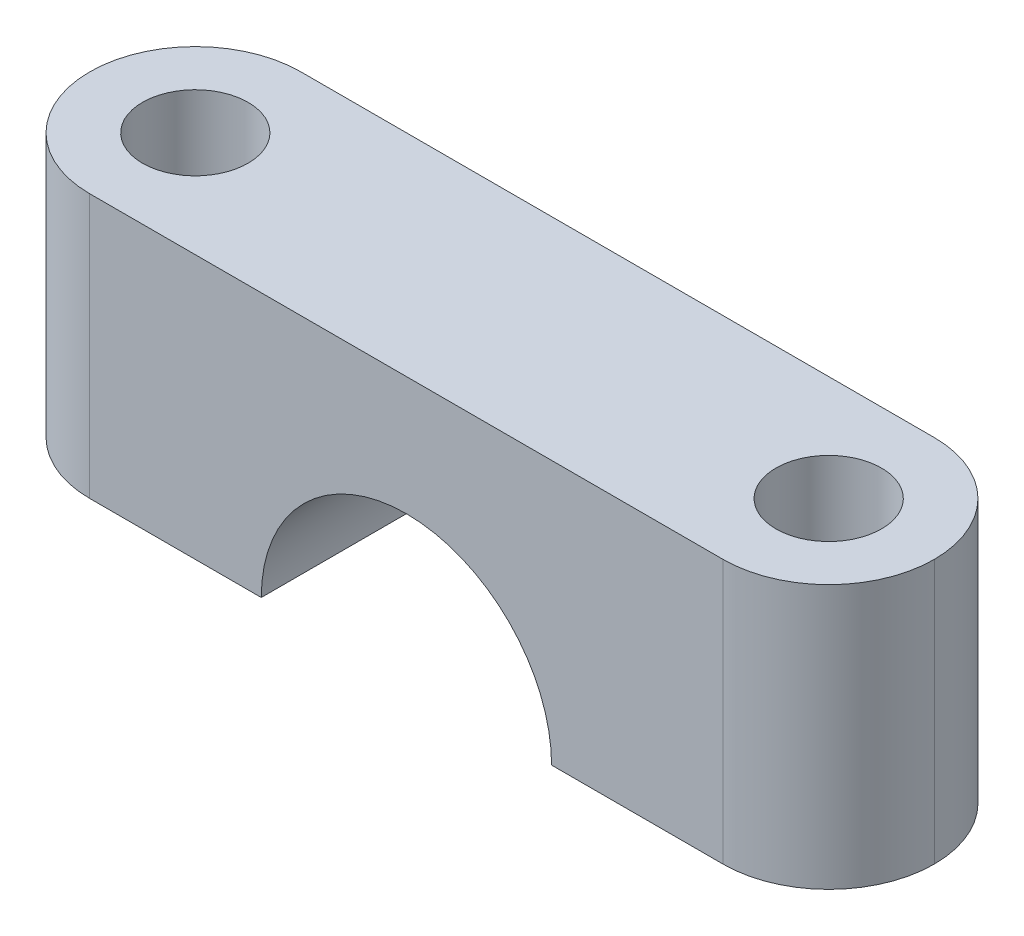
ISO-10303-21;
HEADER;
FILE_DESCRIPTION(('STEP AP214'),'2;1');
FILE_NAME('part.step','',(''),(''),'','','');
FILE_SCHEMA(('AUTOMOTIVE_DESIGN { 1 0 10303 214 1 1 1 1 }'));
ENDSEC;
DATA;
#1=APPLICATION_CONTEXT('core data for automotive mechanical design processes');
#2=APPLICATION_PROTOCOL_DEFINITION('international standard','automotive_design',2000,#1);
#3=PRODUCT_CONTEXT('',#1,'mechanical');
#4=PRODUCT('Part','Part','',(#3));
#5=PRODUCT_RELATED_PRODUCT_CATEGORY('part','',(#4));
#6=PRODUCT_DEFINITION_FORMATION('','',#4);
#7=PRODUCT_DEFINITION_CONTEXT('part definition',#1,'design');
#8=PRODUCT_DEFINITION('design','',#6,#7);
#9=PRODUCT_DEFINITION_SHAPE('','',#8);
#10=(LENGTH_UNIT() NAMED_UNIT(*) SI_UNIT(.MILLI.,.METRE.));
#11=(NAMED_UNIT(*) PLANE_ANGLE_UNIT() SI_UNIT($,.RADIAN.));
#12=(NAMED_UNIT(*) SI_UNIT($,.STERADIAN.) SOLID_ANGLE_UNIT());
#13=UNCERTAINTY_MEASURE_WITH_UNIT(LENGTH_MEASURE(1.E-05),#10,'distance_accuracy_value','');
#14=(GEOMETRIC_REPRESENTATION_CONTEXT(3) GLOBAL_UNCERTAINTY_ASSIGNED_CONTEXT((#13)) GLOBAL_UNIT_ASSIGNED_CONTEXT((#10,
#11,#12)) REPRESENTATION_CONTEXT('',''));
#15=CARTESIAN_POINT('',(0.,0.,0.));
#16=DIRECTION('',(0.,0.,1.));
#17=DIRECTION('',(1.,0.,0.));
#18=AXIS2_PLACEMENT_3D('',#15,#16,#17);
#19=CARTESIAN_POINT('',(0.,0.,6.35));
#20=DIRECTION('',(0.,0.,-1.));
#21=DIRECTION('',(-1.,0.,0.));
#22=AXIS2_PLACEMENT_3D('',#19,#20,#21);
#23=CYLINDRICAL_SURFACE('',#22,8.73125);
#24=CARTESIAN_POINT('',(0.,0.,-6.35));
#25=DIRECTION('',(0.,0.,-1.));
#26=DIRECTION('',(1.,0.,0.));
#27=AXIS2_PLACEMENT_3D('',#24,#25,#26);
#28=CIRCLE('',#27,8.73125);
#29=CARTESIAN_POINT('',(-8.73125,0.,-6.35));
#30=VERTEX_POINT('',#29);
#31=CARTESIAN_POINT('',(8.73125,0.,-6.35));
#32=VERTEX_POINT('',#31);
#33=EDGE_CURVE('E136',#30,#32,#28,.T.);
#34=ORIENTED_EDGE('',*,*,#33,.T.);
#35=DIRECTION('',(0.,0.,-1.));
#36=VECTOR('',#35,1.);
#37=CARTESIAN_POINT('',(8.73125,0.,6.35));
#38=LINE('',#37,#36);
#39=CARTESIAN_POINT('',(8.73125,0.,6.35));
#40=VERTEX_POINT('',#39);
#41=EDGE_CURVE('E119',#40,#32,#38,.T.);
#42=ORIENTED_EDGE('',*,*,#41,.F.);
#43=CARTESIAN_POINT('',(0.,0.,6.35));
#44=DIRECTION('',(0.,0.,-1.));
#45=DIRECTION('',(1.,0.,0.));
#46=AXIS2_PLACEMENT_3D('',#43,#44,#45);
#47=CIRCLE('',#46,8.73125);
#48=CARTESIAN_POINT('',(-8.73125,0.,6.35));
#49=VERTEX_POINT('',#48);
#50=EDGE_CURVE('E125',#49,#40,#47,.T.);
#51=ORIENTED_EDGE('',*,*,#50,.F.);
#52=DIRECTION('',(0.,0.,-1.));
#53=VECTOR('',#52,1.);
#54=CARTESIAN_POINT('',(-8.73125,0.,6.35));
#55=LINE('',#54,#53);
#56=EDGE_CURVE('E138',#49,#30,#55,.T.);
#57=ORIENTED_EDGE('',*,*,#56,.T.);
#58=EDGE_LOOP('',(#34,#42,#51,#57));
#59=FACE_BOUND('',#58,.T.);
#60=ADVANCED_FACE('F48',(#59),#23,.F.);
#61=CARTESIAN_POINT('',(25.4,0.,6.35));
#62=DIRECTION('',(0.,1.,0.));
#63=DIRECTION('',(-1.,0.,0.));
#64=AXIS2_PLACEMENT_3D('',#61,#62,#63);
#65=PLANE('',#64);
#66=CARTESIAN_POINT('',(19.05,0.,0.));
#67=DIRECTION('',(0.,1.,0.));
#68=DIRECTION('',(0.,0.,1.));
#69=AXIS2_PLACEMENT_3D('',#66,#67,#68);
#70=CIRCLE('',#69,3.175);
#71=CARTESIAN_POINT('',(19.05,0.,3.17499999999999));
#72=VERTEX_POINT('',#71);
#73=EDGE_CURVE('E164',#72,#72,#70,.T.);
#74=ORIENTED_EDGE('',*,*,#73,.T.);
#75=EDGE_LOOP('',(#74));
#76=FACE_BOUND('',#75,.T.);
#77=DIRECTION('',(1.,0.,0.));
#78=VECTOR('',#77,1.);
#79=CARTESIAN_POINT('',(25.4,0.,-6.35));
#80=LINE('',#79,#78);
#81=CARTESIAN_POINT('',(19.05,0.,-6.35));
#82=VERTEX_POINT('',#81);
#83=EDGE_CURVE('E187',#32,#82,#80,.T.);
#84=ORIENTED_EDGE('',*,*,#83,.T.);
#85=CARTESIAN_POINT('',(19.05,0.,0.));
#86=DIRECTION('',(0.,1.,0.));
#87=DIRECTION('',(-1.,0.,0.));
#88=AXIS2_PLACEMENT_3D('',#85,#86,#87);
#89=CIRCLE('',#88,6.35);
#90=CARTESIAN_POINT('',(25.4,0.,0.));
#91=VERTEX_POINT('',#90);
#92=EDGE_CURVE('E157',#82,#91,#89,.F.);
#93=ORIENTED_EDGE('',*,*,#92,.T.);
#94=CARTESIAN_POINT('',(19.05,0.,0.));
#95=DIRECTION('',(0.,1.,0.));
#96=DIRECTION('',(-1.,0.,0.));
#97=AXIS2_PLACEMENT_3D('',#94,#95,#96);
#98=CIRCLE('',#97,6.35);
#99=CARTESIAN_POINT('',(19.05,0.,6.35));
#100=VERTEX_POINT('',#99);
#101=EDGE_CURVE('E122',#91,#100,#98,.F.);
#102=ORIENTED_EDGE('',*,*,#101,.T.);
#103=DIRECTION('',(1.,0.,0.));
#104=VECTOR('',#103,1.);
#105=CARTESIAN_POINT('',(25.4,0.,6.35));
#106=LINE('',#105,#104);
#107=EDGE_CURVE('E114',#40,#100,#106,.T.);
#108=ORIENTED_EDGE('',*,*,#107,.F.);
#109=ORIENTED_EDGE('',*,*,#41,.T.);
#110=EDGE_LOOP('',(#84,#93,#102,#108,#109));
#111=FACE_BOUND('',#110,.T.);
#112=ADVANCED_FACE('F117',(#76,#111),#65,.F.);
#113=CARTESIAN_POINT('',(-25.4,15.875,6.35));
#114=DIRECTION('',(0.,-1.,0.));
#115=DIRECTION('',(0.,0.,-1.));
#116=AXIS2_PLACEMENT_3D('',#113,#114,#115);
#117=PLANE('',#116);
#118=CARTESIAN_POINT('',(-19.05,15.875,0.));
#119=DIRECTION('',(0.,1.,0.));
#120=DIRECTION('',(0.,0.,1.));
#121=AXIS2_PLACEMENT_3D('',#118,#119,#120);
#122=CIRCLE('',#121,3.175);
#123=CARTESIAN_POINT('',(-19.05,15.875,3.17500000000001));
#124=VERTEX_POINT('',#123);
#125=EDGE_CURVE('E188',#124,#124,#122,.T.);
#126=ORIENTED_EDGE('',*,*,#125,.F.);
#127=EDGE_LOOP('',(#126));
#128=FACE_BOUND('',#127,.T.);
#129=CARTESIAN_POINT('',(19.05,15.875,0.));
#130=DIRECTION('',(0.,1.,0.));
#131=DIRECTION('',(0.,0.,1.));
#132=AXIS2_PLACEMENT_3D('',#129,#130,#131);
#133=CIRCLE('',#132,3.175);
#134=CARTESIAN_POINT('',(19.05,15.875,3.17499999999999));
#135=VERTEX_POINT('',#134);
#136=EDGE_CURVE('E169',#135,#135,#133,.T.);
#137=ORIENTED_EDGE('',*,*,#136,.F.);
#138=EDGE_LOOP('',(#137));
#139=FACE_BOUND('',#138,.T.);
#140=CARTESIAN_POINT('',(19.05,15.875,0.));
#141=DIRECTION('',(0.,-1.,0.));
#142=DIRECTION('',(0.,0.,-1.));
#143=AXIS2_PLACEMENT_3D('',#140,#141,#142);
#144=CIRCLE('',#143,6.35);
#145=CARTESIAN_POINT('',(19.05,15.875,6.35));
#146=VERTEX_POINT('',#145);
#147=CARTESIAN_POINT('',(25.4,15.875,0.));
#148=VERTEX_POINT('',#147);
#149=EDGE_CURVE('E146',#146,#148,#144,.F.);
#150=ORIENTED_EDGE('',*,*,#149,.T.);
#151=CARTESIAN_POINT('',(19.05,15.875,0.));
#152=DIRECTION('',(0.,-1.,0.));
#153=DIRECTION('',(0.,0.,-1.));
#154=AXIS2_PLACEMENT_3D('',#151,#152,#153);
#155=CIRCLE('',#154,6.35);
#156=CARTESIAN_POINT('',(19.05,15.875,-6.35));
#157=VERTEX_POINT('',#156);
#158=EDGE_CURVE('E148',#148,#157,#155,.F.);
#159=ORIENTED_EDGE('',*,*,#158,.T.);
#160=DIRECTION('',(-1.,0.,0.));
#161=VECTOR('',#160,1.);
#162=CARTESIAN_POINT('',(-25.4,15.875,-6.35));
#163=LINE('',#162,#161);
#164=CARTESIAN_POINT('',(-19.05,15.875,-6.35));
#165=VERTEX_POINT('',#164);
#166=EDGE_CURVE('E190',#157,#165,#163,.T.);
#167=ORIENTED_EDGE('',*,*,#166,.T.);
#168=CARTESIAN_POINT('',(-19.05,15.875,0.));
#169=DIRECTION('',(0.,-1.,0.));
#170=DIRECTION('',(0.,0.,-1.));
#171=AXIS2_PLACEMENT_3D('',#168,#169,#170);
#172=CIRCLE('',#171,6.35);
#173=CARTESIAN_POINT('',(-25.4,15.875,0.));
#174=VERTEX_POINT('',#173);
#175=EDGE_CURVE('E140',#165,#174,#172,.F.);
#176=ORIENTED_EDGE('',*,*,#175,.T.);
#177=CARTESIAN_POINT('',(-19.05,15.875,0.));
#178=DIRECTION('',(0.,-1.,0.));
#179=DIRECTION('',(0.,0.,-1.));
#180=AXIS2_PLACEMENT_3D('',#177,#178,#179);
#181=CIRCLE('',#180,6.35);
#182=CARTESIAN_POINT('',(-19.05,15.875,6.35));
#183=VERTEX_POINT('',#182);
#184=EDGE_CURVE('E137',#174,#183,#181,.F.);
#185=ORIENTED_EDGE('',*,*,#184,.T.);
#186=DIRECTION('',(-1.,0.,0.));
#187=VECTOR('',#186,1.);
#188=CARTESIAN_POINT('',(-25.4,15.875,6.35));
#189=LINE('',#188,#187);
#190=EDGE_CURVE('E124',#146,#183,#189,.T.);
#191=ORIENTED_EDGE('',*,*,#190,.F.);
#192=EDGE_LOOP('',(#150,#159,#167,#176,#185,#191));
#193=FACE_BOUND('',#192,.T.);
#194=ADVANCED_FACE('F180',(#128,#139,#193),#117,.F.);
#195=CARTESIAN_POINT('',(-8.73125,0.,6.35));
#196=DIRECTION('',(0.,1.,0.));
#197=DIRECTION('',(-1.,0.,0.));
#198=AXIS2_PLACEMENT_3D('',#195,#196,#197);
#199=PLANE('',#198);
#200=CARTESIAN_POINT('',(-19.05,0.,0.));
#201=DIRECTION('',(0.,1.,0.));
#202=DIRECTION('',(0.,0.,1.));
#203=AXIS2_PLACEMENT_3D('',#200,#201,#202);
#204=CIRCLE('',#203,3.175);
#205=CARTESIAN_POINT('',(-19.05,0.,3.17500000000001));
#206=VERTEX_POINT('',#205);
#207=EDGE_CURVE('E239',#206,#206,#204,.T.);
#208=ORIENTED_EDGE('',*,*,#207,.T.);
#209=EDGE_LOOP('',(#208));
#210=FACE_BOUND('',#209,.T.);
#211=CARTESIAN_POINT('',(-19.05,0.,0.));
#212=DIRECTION('',(0.,1.,0.));
#213=DIRECTION('',(-1.,0.,0.));
#214=AXIS2_PLACEMENT_3D('',#211,#212,#213);
#215=CIRCLE('',#214,6.35);
#216=CARTESIAN_POINT('',(-19.05,0.,6.35));
#217=VERTEX_POINT('',#216);
#218=CARTESIAN_POINT('',(-25.4,0.,0.));
#219=VERTEX_POINT('',#218);
#220=EDGE_CURVE('E57',#217,#219,#215,.F.);
#221=ORIENTED_EDGE('',*,*,#220,.T.);
#222=CARTESIAN_POINT('',(-19.05,0.,0.));
#223=DIRECTION('',(0.,1.,0.));
#224=DIRECTION('',(-1.,0.,0.));
#225=AXIS2_PLACEMENT_3D('',#222,#223,#224);
#226=CIRCLE('',#225,6.35);
#227=CARTESIAN_POINT('',(-19.05,0.,-6.35));
#228=VERTEX_POINT('',#227);
#229=EDGE_CURVE('E13',#219,#228,#226,.F.);
#230=ORIENTED_EDGE('',*,*,#229,.T.);
#231=DIRECTION('',(1.,0.,0.));
#232=VECTOR('',#231,1.);
#233=CARTESIAN_POINT('',(-8.73125,0.,-6.35));
#234=LINE('',#233,#232);
#235=EDGE_CURVE('E133',#228,#30,#234,.T.);
#236=ORIENTED_EDGE('',*,*,#235,.T.);
#237=ORIENTED_EDGE('',*,*,#56,.F.);
#238=DIRECTION('',(1.,0.,0.));
#239=VECTOR('',#238,1.);
#240=CARTESIAN_POINT('',(-8.73125,0.,6.35));
#241=LINE('',#240,#239);
#242=EDGE_CURVE('E129',#217,#49,#241,.T.);
#243=ORIENTED_EDGE('',*,*,#242,.F.);
#244=EDGE_LOOP('',(#221,#230,#236,#237,#243));
#245=FACE_BOUND('',#244,.T.);
#246=ADVANCED_FACE('F192',(#210,#245),#199,.F.);
#247=CARTESIAN_POINT('',(0.,0.,6.35));
#248=DIRECTION('',(0.,0.,1.));
#249=DIRECTION('',(1.,0.,0.));
#250=AXIS2_PLACEMENT_3D('',#247,#248,#249);
#251=PLANE('',#250);
#252=ORIENTED_EDGE('',*,*,#107,.T.);
#253=DIRECTION('',(0.,1.,0.));
#254=VECTOR('',#253,1.);
#255=CARTESIAN_POINT('',(19.05,15.875,6.35));
#256=LINE('',#255,#254);
#257=EDGE_CURVE('E160',#100,#146,#256,.T.);
#258=ORIENTED_EDGE('',*,*,#257,.T.);
#259=ORIENTED_EDGE('',*,*,#190,.T.);
#260=DIRECTION('',(0.,-1.,0.));
#261=VECTOR('',#260,1.);
#262=CARTESIAN_POINT('',(-19.05,0.,6.35));
#263=LINE('',#262,#261);
#264=EDGE_CURVE('E71',#183,#217,#263,.T.);
#265=ORIENTED_EDGE('',*,*,#264,.T.);
#266=ORIENTED_EDGE('',*,*,#242,.T.);
#267=ORIENTED_EDGE('',*,*,#50,.T.);
#268=EDGE_LOOP('',(#252,#258,#259,#265,#266,#267));
#269=FACE_BOUND('',#268,.T.);
#270=ADVANCED_FACE('F128',(#269),#251,.T.);
#271=CARTESIAN_POINT('',(0.,0.,-6.35));
#272=DIRECTION('',(0.,0.,1.));
#273=DIRECTION('',(1.,0.,0.));
#274=AXIS2_PLACEMENT_3D('',#271,#272,#273);
#275=PLANE('',#274);
#276=ORIENTED_EDGE('',*,*,#166,.F.);
#277=DIRECTION('',(0.,1.,0.));
#278=VECTOR('',#277,1.);
#279=CARTESIAN_POINT('',(19.05,0.,-6.35));
#280=LINE('',#279,#278);
#281=EDGE_CURVE('E153',#157,#82,#280,.F.);
#282=ORIENTED_EDGE('',*,*,#281,.T.);
#283=ORIENTED_EDGE('',*,*,#83,.F.);
#284=ORIENTED_EDGE('',*,*,#33,.F.);
#285=ORIENTED_EDGE('',*,*,#235,.F.);
#286=DIRECTION('',(0.,-1.,0.));
#287=VECTOR('',#286,1.);
#288=CARTESIAN_POINT('',(-19.05,0.,-6.35));
#289=LINE('',#288,#287);
#290=EDGE_CURVE('E150',#228,#165,#289,.F.);
#291=ORIENTED_EDGE('',*,*,#290,.T.);
#292=EDGE_LOOP('',(#276,#282,#283,#284,#285,#291));
#293=FACE_BOUND('',#292,.T.);
#294=ADVANCED_FACE('F195',(#293),#275,.F.);
#295=CARTESIAN_POINT('',(-19.05,15.875,0.));
#296=DIRECTION('',(0.,-1.,0.));
#297=DIRECTION('',(0.,0.,-1.));
#298=AXIS2_PLACEMENT_3D('',#295,#296,#297);
#299=CYLINDRICAL_SURFACE('',#298,3.175);
#300=ORIENTED_EDGE('',*,*,#125,.T.);
#301=EDGE_LOOP('',(#300));
#302=FACE_BOUND('',#301,.T.);
#303=ORIENTED_EDGE('',*,*,#207,.F.);
#304=EDGE_LOOP('',(#303));
#305=FACE_BOUND('',#304,.T.);
#306=ADVANCED_FACE('F224',(#302,#305),#299,.F.);
#307=CARTESIAN_POINT('',(19.05,15.875,0.));
#308=DIRECTION('',(0.,-1.,0.));
#309=DIRECTION('',(0.,0.,-1.));
#310=AXIS2_PLACEMENT_3D('',#307,#308,#309);
#311=CYLINDRICAL_SURFACE('',#310,3.175);
#312=ORIENTED_EDGE('',*,*,#136,.T.);
#313=EDGE_LOOP('',(#312));
#314=FACE_BOUND('',#313,.T.);
#315=ORIENTED_EDGE('',*,*,#73,.F.);
#316=EDGE_LOOP('',(#315));
#317=FACE_BOUND('',#316,.T.);
#318=ADVANCED_FACE('F206',(#314,#317),#311,.F.);
#319=CARTESIAN_POINT('',(19.05,0.,0.));
#320=DIRECTION('',(0.,-1.,0.));
#321=DIRECTION('',(0.,0.,-1.));
#322=AXIS2_PLACEMENT_3D('',#319,#320,#321);
#323=CYLINDRICAL_SURFACE('',#322,6.35);
#324=ORIENTED_EDGE('',*,*,#257,.F.);
#325=ORIENTED_EDGE('',*,*,#101,.F.);
#326=DIRECTION('',(0.,1.,0.));
#327=VECTOR('',#326,1.);
#328=CARTESIAN_POINT('',(25.4,0.,0.));
#329=LINE('',#328,#327);
#330=EDGE_CURVE('E162',#148,#91,#329,.F.);
#331=ORIENTED_EDGE('',*,*,#330,.F.);
#332=ORIENTED_EDGE('',*,*,#149,.F.);
#333=EDGE_LOOP('',(#324,#325,#331,#332));
#334=FACE_BOUND('',#333,.T.);
#335=ADVANCED_FACE('F198',(#334),#323,.T.);
#336=CARTESIAN_POINT('',(19.05,15.875,0.));
#337=DIRECTION('',(0.,1.,0.));
#338=DIRECTION('',(0.,0.,1.));
#339=AXIS2_PLACEMENT_3D('',#336,#337,#338);
#340=CYLINDRICAL_SURFACE('',#339,6.35);
#341=ORIENTED_EDGE('',*,*,#92,.F.);
#342=ORIENTED_EDGE('',*,*,#281,.F.);
#343=ORIENTED_EDGE('',*,*,#158,.F.);
#344=ORIENTED_EDGE('',*,*,#330,.T.);
#345=EDGE_LOOP('',(#341,#342,#343,#344));
#346=FACE_BOUND('',#345,.T.);
#347=ADVANCED_FACE('F199',(#346),#340,.T.);
#348=CARTESIAN_POINT('',(-19.05,0.,0.));
#349=DIRECTION('',(0.,1.,0.));
#350=DIRECTION('',(0.,0.,1.));
#351=AXIS2_PLACEMENT_3D('',#348,#349,#350);
#352=CYLINDRICAL_SURFACE('',#351,6.35);
#353=ORIENTED_EDGE('',*,*,#264,.F.);
#354=ORIENTED_EDGE('',*,*,#184,.F.);
#355=DIRECTION('',(0.,-1.,0.));
#356=VECTOR('',#355,1.);
#357=CARTESIAN_POINT('',(-25.4,15.875,0.));
#358=LINE('',#357,#356);
#359=EDGE_CURVE('E52',#219,#174,#358,.F.);
#360=ORIENTED_EDGE('',*,*,#359,.F.);
#361=ORIENTED_EDGE('',*,*,#220,.F.);
#362=EDGE_LOOP('',(#353,#354,#360,#361));
#363=FACE_BOUND('',#362,.T.);
#364=ADVANCED_FACE('F50',(#363),#352,.T.);
#365=CARTESIAN_POINT('',(-19.05,0.,0.));
#366=DIRECTION('',(0.,-1.,0.));
#367=DIRECTION('',(0.,0.,-1.));
#368=AXIS2_PLACEMENT_3D('',#365,#366,#367);
#369=CYLINDRICAL_SURFACE('',#368,6.35);
#370=ORIENTED_EDGE('',*,*,#175,.F.);
#371=ORIENTED_EDGE('',*,*,#290,.F.);
#372=ORIENTED_EDGE('',*,*,#229,.F.);
#373=ORIENTED_EDGE('',*,*,#359,.T.);
#374=EDGE_LOOP('',(#370,#371,#372,#373));
#375=FACE_BOUND('',#374,.T.);
#376=ADVANCED_FACE('F174',(#375),#369,.T.);
#377=CLOSED_SHELL('',(#60,#112,#194,#246,#270,#294,#306,#318,#335,#347,#364,#376));
#378=MANIFOLD_SOLID_BREP('B2',#377);
#379=ADVANCED_BREP_SHAPE_REPRESENTATION('',(#18,#378),#14);
#380=SHAPE_DEFINITION_REPRESENTATION(#9,#379);
ENDSEC;
END-ISO-10303-21;
